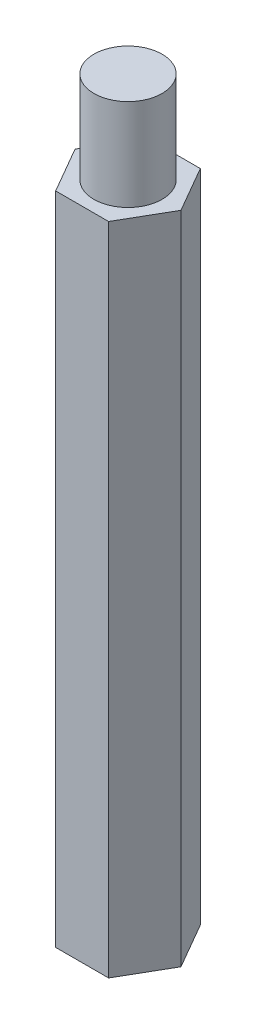
ISO-10303-21;
HEADER;
FILE_DESCRIPTION(('STEP AP214'),'2;1');
FILE_NAME('part.step','',(''),(''),'','','');
FILE_SCHEMA(('AUTOMOTIVE_DESIGN { 1 0 10303 214 1 1 1 1 }'));
ENDSEC;
DATA;
#1=APPLICATION_CONTEXT('core data for automotive mechanical design processes');
#2=APPLICATION_PROTOCOL_DEFINITION('international standard','automotive_design',2000,#1);
#3=PRODUCT_CONTEXT('',#1,'mechanical');
#4=PRODUCT('Part','Part','',(#3));
#5=PRODUCT_RELATED_PRODUCT_CATEGORY('part','',(#4));
#6=PRODUCT_DEFINITION_FORMATION('','',#4);
#7=PRODUCT_DEFINITION_CONTEXT('part definition',#1,'design');
#8=PRODUCT_DEFINITION('design','',#6,#7);
#9=PRODUCT_DEFINITION_SHAPE('','',#8);
#10=(LENGTH_UNIT() NAMED_UNIT(*) SI_UNIT(.MILLI.,.METRE.));
#11=(NAMED_UNIT(*) PLANE_ANGLE_UNIT() SI_UNIT($,.RADIAN.));
#12=(NAMED_UNIT(*) SI_UNIT($,.STERADIAN.) SOLID_ANGLE_UNIT());
#13=UNCERTAINTY_MEASURE_WITH_UNIT(LENGTH_MEASURE(1.E-05),#10,'distance_accuracy_value','');
#14=(GEOMETRIC_REPRESENTATION_CONTEXT(3) GLOBAL_UNCERTAINTY_ASSIGNED_CONTEXT((#13)) GLOBAL_UNIT_ASSIGNED_CONTEXT((#10,
#11,#12)) REPRESENTATION_CONTEXT('',''));
#15=CARTESIAN_POINT('',(0.,0.,0.));
#16=DIRECTION('',(0.,0.,1.));
#17=DIRECTION('',(1.,0.,0.));
#18=AXIS2_PLACEMENT_3D('',#15,#16,#17);
#19=CARTESIAN_POINT('',(2.02072594216369,50.,3.5));
#20=DIRECTION('',(-0.866025403784439,0.,-0.5));
#21=DIRECTION('',(-0.5,0.,0.866025403784439));
#22=AXIS2_PLACEMENT_3D('',#19,#20,#21);
#23=PLANE('',#22);
#24=DIRECTION('',(0.5,0.,-0.866025403784439));
#25=VECTOR('',#24,1.);
#26=CARTESIAN_POINT('',(2.02072594216369,0.,3.5));
#27=LINE('',#26,#25);
#28=CARTESIAN_POINT('',(2.02072594216369,0.,3.5));
#29=VERTEX_POINT('',#28);
#30=CARTESIAN_POINT('',(4.04145188432738,0.,0.));
#31=VERTEX_POINT('',#30);
#32=EDGE_CURVE('E121',#29,#31,#27,.T.);
#33=ORIENTED_EDGE('',*,*,#32,.T.);
#34=DIRECTION('',(0.,-1.,0.));
#35=VECTOR('',#34,1.);
#36=CARTESIAN_POINT('',(4.04145188432738,50.,0.));
#37=LINE('',#36,#35);
#38=CARTESIAN_POINT('',(4.04145188432738,50.,0.));
#39=VERTEX_POINT('',#38);
#40=EDGE_CURVE('E12',#39,#31,#37,.T.);
#41=ORIENTED_EDGE('',*,*,#40,.F.);
#42=DIRECTION('',(0.5,0.,-0.866025403784439));
#43=VECTOR('',#42,1.);
#44=CARTESIAN_POINT('',(2.02072594216369,50.,3.5));
#45=LINE('',#44,#43);
#46=CARTESIAN_POINT('',(2.02072594216369,50.,3.5));
#47=VERTEX_POINT('',#46);
#48=EDGE_CURVE('E132',#47,#39,#45,.T.);
#49=ORIENTED_EDGE('',*,*,#48,.F.);
#50=DIRECTION('',(0.,-1.,0.));
#51=VECTOR('',#50,1.);
#52=CARTESIAN_POINT('',(2.02072594216369,50.,3.5));
#53=LINE('',#52,#51);
#54=EDGE_CURVE('E117',#47,#29,#53,.T.);
#55=ORIENTED_EDGE('',*,*,#54,.T.);
#56=EDGE_LOOP('',(#33,#41,#49,#55));
#57=FACE_BOUND('',#56,.T.);
#58=ADVANCED_FACE('F37',(#57),#23,.F.);
#59=CARTESIAN_POINT('',(4.04145188432738,50.,0.));
#60=DIRECTION('',(-0.866025403784439,0.,0.5));
#61=DIRECTION('',(0.5,0.,0.866025403784439));
#62=AXIS2_PLACEMENT_3D('',#59,#60,#61);
#63=PLANE('',#62);
#64=DIRECTION('',(-0.5,0.,-0.866025403784439));
#65=VECTOR('',#64,1.);
#66=CARTESIAN_POINT('',(4.04145188432738,0.,0.));
#67=LINE('',#66,#65);
#68=CARTESIAN_POINT('',(2.02072594216369,0.,-3.5));
#69=VERTEX_POINT('',#68);
#70=EDGE_CURVE('E124',#31,#69,#67,.T.);
#71=ORIENTED_EDGE('',*,*,#70,.T.);
#72=DIRECTION('',(0.,-1.,0.));
#73=VECTOR('',#72,1.);
#74=CARTESIAN_POINT('',(2.02072594216369,50.,-3.5));
#75=LINE('',#74,#73);
#76=CARTESIAN_POINT('',(2.02072594216369,50.,-3.5));
#77=VERTEX_POINT('',#76);
#78=EDGE_CURVE('E45',#77,#69,#75,.T.);
#79=ORIENTED_EDGE('',*,*,#78,.F.);
#80=DIRECTION('',(-0.5,0.,-0.866025403784439));
#81=VECTOR('',#80,1.);
#82=CARTESIAN_POINT('',(4.04145188432738,50.,0.));
#83=LINE('',#82,#81);
#84=EDGE_CURVE('E90',#39,#77,#83,.T.);
#85=ORIENTED_EDGE('',*,*,#84,.F.);
#86=ORIENTED_EDGE('',*,*,#40,.T.);
#87=EDGE_LOOP('',(#71,#79,#85,#86));
#88=FACE_BOUND('',#87,.T.);
#89=ADVANCED_FACE('F157',(#88),#63,.F.);
#90=CARTESIAN_POINT('',(2.02072594216369,50.,-3.5));
#91=DIRECTION('',(0.,0.,1.));
#92=DIRECTION('',(1.,0.,0.));
#93=AXIS2_PLACEMENT_3D('',#90,#91,#92);
#94=PLANE('',#93);
#95=DIRECTION('',(-1.,0.,0.));
#96=VECTOR('',#95,1.);
#97=CARTESIAN_POINT('',(2.02072594216369,0.,-3.5));
#98=LINE('',#97,#96);
#99=CARTESIAN_POINT('',(-2.02072594216369,0.,-3.5));
#100=VERTEX_POINT('',#99);
#101=EDGE_CURVE('E127',#69,#100,#98,.T.);
#102=ORIENTED_EDGE('',*,*,#101,.T.);
#103=DIRECTION('',(0.,-1.,0.));
#104=VECTOR('',#103,1.);
#105=CARTESIAN_POINT('',(-2.02072594216369,50.,-3.5));
#106=LINE('',#105,#104);
#107=CARTESIAN_POINT('',(-2.02072594216369,50.,-3.5));
#108=VERTEX_POINT('',#107);
#109=EDGE_CURVE('E112',#108,#100,#106,.T.);
#110=ORIENTED_EDGE('',*,*,#109,.F.);
#111=DIRECTION('',(-1.,0.,0.));
#112=VECTOR('',#111,1.);
#113=CARTESIAN_POINT('',(2.02072594216369,50.,-3.5));
#114=LINE('',#113,#112);
#115=EDGE_CURVE('E103',#77,#108,#114,.T.);
#116=ORIENTED_EDGE('',*,*,#115,.F.);
#117=ORIENTED_EDGE('',*,*,#78,.T.);
#118=EDGE_LOOP('',(#102,#110,#116,#117));
#119=FACE_BOUND('',#118,.T.);
#120=ADVANCED_FACE('F138',(#119),#94,.F.);
#121=CARTESIAN_POINT('',(-2.02072594216369,50.,-3.5));
#122=DIRECTION('',(0.866025403784438,0.,0.5));
#123=DIRECTION('',(0.5,0.,-0.866025403784438));
#124=AXIS2_PLACEMENT_3D('',#121,#122,#123);
#125=PLANE('',#124);
#126=DIRECTION('',(-0.5,0.,0.866025403784439));
#127=VECTOR('',#126,1.);
#128=CARTESIAN_POINT('',(-2.02072594216369,0.,-3.5));
#129=LINE('',#128,#127);
#130=CARTESIAN_POINT('',(-4.04145188432738,0.,0.));
#131=VERTEX_POINT('',#130);
#132=EDGE_CURVE('E111',#100,#131,#129,.T.);
#133=ORIENTED_EDGE('',*,*,#132,.T.);
#134=DIRECTION('',(0.,-1.,0.));
#135=VECTOR('',#134,1.);
#136=CARTESIAN_POINT('',(-4.04145188432738,50.,0.));
#137=LINE('',#136,#135);
#138=CARTESIAN_POINT('',(-4.04145188432738,50.,0.));
#139=VERTEX_POINT('',#138);
#140=EDGE_CURVE('E108',#139,#131,#137,.T.);
#141=ORIENTED_EDGE('',*,*,#140,.F.);
#142=DIRECTION('',(-0.5,0.,0.866025403784439));
#143=VECTOR('',#142,1.);
#144=CARTESIAN_POINT('',(-2.02072594216369,50.,-3.5));
#145=LINE('',#144,#143);
#146=EDGE_CURVE('E97',#108,#139,#145,.T.);
#147=ORIENTED_EDGE('',*,*,#146,.F.);
#148=ORIENTED_EDGE('',*,*,#109,.T.);
#149=EDGE_LOOP('',(#133,#141,#147,#148));
#150=FACE_BOUND('',#149,.T.);
#151=ADVANCED_FACE('F109',(#150),#125,.F.);
#152=CARTESIAN_POINT('',(-4.04145188432738,50.,0.));
#153=DIRECTION('',(0.866025403784439,0.,-0.5));
#154=DIRECTION('',(-0.5,0.,-0.866025403784439));
#155=AXIS2_PLACEMENT_3D('',#152,#153,#154);
#156=PLANE('',#155);
#157=DIRECTION('',(0.5,0.,0.866025403784439));
#158=VECTOR('',#157,1.);
#159=CARTESIAN_POINT('',(-4.04145188432738,0.,0.));
#160=LINE('',#159,#158);
#161=CARTESIAN_POINT('',(-2.02072594216369,0.,3.5));
#162=VERTEX_POINT('',#161);
#163=EDGE_CURVE('E76',#131,#162,#160,.T.);
#164=ORIENTED_EDGE('',*,*,#163,.T.);
#165=DIRECTION('',(0.,-1.,0.));
#166=VECTOR('',#165,1.);
#167=CARTESIAN_POINT('',(-2.02072594216369,50.,3.5));
#168=LINE('',#167,#166);
#169=CARTESIAN_POINT('',(-2.02072594216369,50.,3.5));
#170=VERTEX_POINT('',#169);
#171=EDGE_CURVE('E113',#170,#162,#168,.T.);
#172=ORIENTED_EDGE('',*,*,#171,.F.);
#173=DIRECTION('',(0.5,0.,0.866025403784439));
#174=VECTOR('',#173,1.);
#175=CARTESIAN_POINT('',(-4.04145188432738,50.,0.));
#176=LINE('',#175,#174);
#177=EDGE_CURVE('E101',#139,#170,#176,.T.);
#178=ORIENTED_EDGE('',*,*,#177,.F.);
#179=ORIENTED_EDGE('',*,*,#140,.T.);
#180=EDGE_LOOP('',(#164,#172,#178,#179));
#181=FACE_BOUND('',#180,.T.);
#182=ADVANCED_FACE('F115',(#181),#156,.F.);
#183=CARTESIAN_POINT('',(-2.02072594216369,50.,3.5));
#184=DIRECTION('',(0.,0.,-1.));
#185=DIRECTION('',(-1.,0.,0.));
#186=AXIS2_PLACEMENT_3D('',#183,#184,#185);
#187=PLANE('',#186);
#188=DIRECTION('',(1.,0.,0.));
#189=VECTOR('',#188,1.);
#190=CARTESIAN_POINT('',(-2.02072594216369,0.,3.5));
#191=LINE('',#190,#189);
#192=EDGE_CURVE('E82',#162,#29,#191,.T.);
#193=ORIENTED_EDGE('',*,*,#192,.T.);
#194=ORIENTED_EDGE('',*,*,#54,.F.);
#195=DIRECTION('',(1.,0.,0.));
#196=VECTOR('',#195,1.);
#197=CARTESIAN_POINT('',(-2.02072594216369,50.,3.5));
#198=LINE('',#197,#196);
#199=EDGE_CURVE('E53',#170,#47,#198,.T.);
#200=ORIENTED_EDGE('',*,*,#199,.F.);
#201=ORIENTED_EDGE('',*,*,#171,.T.);
#202=EDGE_LOOP('',(#193,#194,#200,#201));
#203=FACE_BOUND('',#202,.T.);
#204=ADVANCED_FACE('F145',(#203),#187,.F.);
#205=CARTESIAN_POINT('',(0.,50.,0.));
#206=DIRECTION('',(0.,1.,0.));
#207=DIRECTION('',(0.,0.,1.));
#208=AXIS2_PLACEMENT_3D('',#205,#206,#207);
#209=PLANE('',#208);
#210=CARTESIAN_POINT('',(0.,50.,0.));
#211=DIRECTION('',(0.,1.,0.));
#212=DIRECTION('',(0.,0.,1.));
#213=AXIS2_PLACEMENT_3D('',#210,#211,#212);
#214=CIRCLE('',#213,2.6);
#215=CARTESIAN_POINT('',(0.,50.,2.6));
#216=VERTEX_POINT('',#215);
#217=EDGE_CURVE('E240',#216,#216,#214,.T.);
#218=ORIENTED_EDGE('',*,*,#217,.F.);
#219=EDGE_LOOP('',(#218));
#220=FACE_BOUND('',#219,.T.);
#221=ORIENTED_EDGE('',*,*,#48,.T.);
#222=ORIENTED_EDGE('',*,*,#84,.T.);
#223=ORIENTED_EDGE('',*,*,#115,.T.);
#224=ORIENTED_EDGE('',*,*,#146,.T.);
#225=ORIENTED_EDGE('',*,*,#177,.T.);
#226=ORIENTED_EDGE('',*,*,#199,.T.);
#227=EDGE_LOOP('',(#221,#222,#223,#224,#225,#226));
#228=FACE_BOUND('',#227,.T.);
#229=ADVANCED_FACE('F99',(#220,#228),#209,.T.);
#230=CARTESIAN_POINT('',(0.,0.,0.));
#231=DIRECTION('',(0.,1.,0.));
#232=DIRECTION('',(0.,0.,1.));
#233=AXIS2_PLACEMENT_3D('',#230,#231,#232);
#234=PLANE('',#233);
#235=CARTESIAN_POINT('',(0.,0.,0.));
#236=DIRECTION('',(0.,1.,0.));
#237=DIRECTION('',(0.,0.,1.));
#238=AXIS2_PLACEMENT_3D('',#235,#236,#237);
#239=CIRCLE('',#238,2.6);
#240=CARTESIAN_POINT('',(0.,0.,2.6));
#241=VERTEX_POINT('',#240);
#242=EDGE_CURVE('E125',#241,#241,#239,.T.);
#243=ORIENTED_EDGE('',*,*,#242,.T.);
#244=EDGE_LOOP('',(#243));
#245=FACE_BOUND('',#244,.T.);
#246=ORIENTED_EDGE('',*,*,#32,.F.);
#247=ORIENTED_EDGE('',*,*,#192,.F.);
#248=ORIENTED_EDGE('',*,*,#163,.F.);
#249=ORIENTED_EDGE('',*,*,#132,.F.);
#250=ORIENTED_EDGE('',*,*,#101,.F.);
#251=ORIENTED_EDGE('',*,*,#70,.F.);
#252=EDGE_LOOP('',(#246,#247,#248,#249,#250,#251));
#253=FACE_BOUND('',#252,.T.);
#254=ADVANCED_FACE('F141',(#245,#253),#234,.F.);
#255=CARTESIAN_POINT('',(0.,0.,0.));
#256=DIRECTION('',(0.,1.,0.));
#257=DIRECTION('',(0.,0.,1.));
#258=AXIS2_PLACEMENT_3D('',#255,#256,#257);
#259=CYLINDRICAL_SURFACE('',#258,2.6);
#260=CARTESIAN_POINT('',(0.,10.,0.));
#261=DIRECTION('',(0.,-1.,0.));
#262=DIRECTION('',(0.,0.,-1.));
#263=AXIS2_PLACEMENT_3D('',#260,#261,#262);
#264=CIRCLE('',#263,2.6);
#265=CARTESIAN_POINT('',(0.,10.,-2.6));
#266=VERTEX_POINT('',#265);
#267=EDGE_CURVE('E244',#266,#266,#264,.T.);
#268=ORIENTED_EDGE('',*,*,#267,.F.);
#269=EDGE_LOOP('',(#268));
#270=FACE_BOUND('',#269,.T.);
#271=ORIENTED_EDGE('',*,*,#242,.F.);
#272=EDGE_LOOP('',(#271));
#273=FACE_BOUND('',#272,.T.);
#274=ADVANCED_FACE('F194',(#270,#273),#259,.F.);
#275=CARTESIAN_POINT('',(0.,10.,0.));
#276=DIRECTION('',(0.,-1.,0.));
#277=DIRECTION('',(0.,0.,-1.));
#278=AXIS2_PLACEMENT_3D('',#275,#276,#277);
#279=PLANE('',#278);
#280=ORIENTED_EDGE('',*,*,#267,.T.);
#281=EDGE_LOOP('',(#280));
#282=FACE_BOUND('',#281,.T.);
#283=ADVANCED_FACE('F203',(#282),#279,.T.);
#284=CARTESIAN_POINT('',(0.,57.,0.));
#285=DIRECTION('',(0.,1.,0.));
#286=DIRECTION('',(0.,0.,1.));
#287=AXIS2_PLACEMENT_3D('',#284,#285,#286);
#288=PLANE('',#287);
#289=CARTESIAN_POINT('',(0.,57.,0.));
#290=DIRECTION('',(0.,1.,0.));
#291=DIRECTION('',(0.,0.,1.));
#292=AXIS2_PLACEMENT_3D('',#289,#290,#291);
#293=CIRCLE('',#292,2.6);
#294=CARTESIAN_POINT('',(0.,57.,2.6));
#295=VERTEX_POINT('',#294);
#296=EDGE_CURVE('E243',#295,#295,#293,.F.);
#297=ORIENTED_EDGE('',*,*,#296,.F.);
#298=EDGE_LOOP('',(#297));
#299=FACE_BOUND('',#298,.T.);
#300=ADVANCED_FACE('F213',(#299),#288,.T.);
#301=CARTESIAN_POINT('',(0.,71.3539105243401,0.));
#302=DIRECTION('',(0.,-1.,0.));
#303=DIRECTION('',(0.,0.,-1.));
#304=AXIS2_PLACEMENT_3D('',#301,#302,#303);
#305=CYLINDRICAL_SURFACE('',#304,2.6);
#306=ORIENTED_EDGE('',*,*,#217,.T.);
#307=EDGE_LOOP('',(#306));
#308=FACE_BOUND('',#307,.T.);
#309=ORIENTED_EDGE('',*,*,#296,.T.);
#310=EDGE_LOOP('',(#309));
#311=FACE_BOUND('',#310,.T.);
#312=ADVANCED_FACE('F223',(#308,#311),#305,.T.);
#313=CLOSED_SHELL('',(#58,#89,#120,#151,#182,#204,#229,#254,#274,#283,#300,#312));
#314=MANIFOLD_SOLID_BREP('B2',#313);
#315=ADVANCED_BREP_SHAPE_REPRESENTATION('',(#18,#314),#14);
#316=SHAPE_DEFINITION_REPRESENTATION(#9,#315);
ENDSEC;
END-ISO-10303-21;
